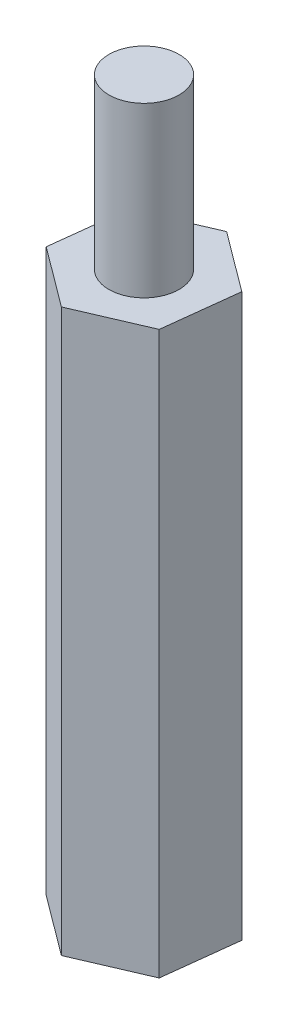
ISO-10303-21;
HEADER;
FILE_DESCRIPTION(('STEP AP214'),'2;1');
FILE_NAME('part.step','',(''),(''),'','','');
FILE_SCHEMA(('AUTOMOTIVE_DESIGN { 1 0 10303 214 1 1 1 1 }'));
ENDSEC;
DATA;
#1=APPLICATION_CONTEXT('core data for automotive mechanical design processes');
#2=APPLICATION_PROTOCOL_DEFINITION('international standard','automotive_design',2000,#1);
#3=PRODUCT_CONTEXT('',#1,'mechanical');
#4=PRODUCT('Part','Part','',(#3));
#5=PRODUCT_RELATED_PRODUCT_CATEGORY('part','',(#4));
#6=PRODUCT_DEFINITION_FORMATION('','',#4);
#7=PRODUCT_DEFINITION_CONTEXT('part definition',#1,'design');
#8=PRODUCT_DEFINITION('design','',#6,#7);
#9=PRODUCT_DEFINITION_SHAPE('','',#8);
#10=(LENGTH_UNIT() NAMED_UNIT(*) SI_UNIT(.MILLI.,.METRE.));
#11=(NAMED_UNIT(*) PLANE_ANGLE_UNIT() SI_UNIT($,.RADIAN.));
#12=(NAMED_UNIT(*) SI_UNIT($,.STERADIAN.) SOLID_ANGLE_UNIT());
#13=UNCERTAINTY_MEASURE_WITH_UNIT(LENGTH_MEASURE(1.E-05),#10,'distance_accuracy_value','');
#14=(GEOMETRIC_REPRESENTATION_CONTEXT(3) GLOBAL_UNCERTAINTY_ASSIGNED_CONTEXT((#13)) GLOBAL_UNIT_ASSIGNED_CONTEXT((#10,
#11,#12)) REPRESENTATION_CONTEXT('',''));
#15=CARTESIAN_POINT('',(0.,0.,0.));
#16=DIRECTION('',(0.,0.,1.));
#17=DIRECTION('',(1.,0.,0.));
#18=AXIS2_PLACEMENT_3D('',#15,#16,#17);
#19=CARTESIAN_POINT('',(-0.30848263547383,20.,2.63198375063584));
#20=DIRECTION('',(-0.395787953347626,0.,-0.918341927598265));
#21=DIRECTION('',(-0.918341927598265,0.,0.395787953347627));
#22=AXIS2_PLACEMENT_3D('',#19,#20,#21);
#23=PLANE('',#22);
#24=DIRECTION('',(0.918341927598265,0.,-0.395787953347626));
#25=VECTOR('',#24,1.);
#26=CARTESIAN_POINT('',(-0.30848263547383,0.,2.63198375063584));
#27=LINE('',#26,#25);
#28=CARTESIAN_POINT('',(-0.30848263547383,0.,2.63198375063584));
#29=VERTEX_POINT('',#28);
#30=CARTESIAN_POINT('',(2.12512347266157,0.,1.58314567426463));
#31=VERTEX_POINT('',#30);
#32=EDGE_CURVE('E125',#29,#31,#27,.T.);
#33=ORIENTED_EDGE('',*,*,#32,.T.);
#34=DIRECTION('',(0.,-1.,0.));
#35=VECTOR('',#34,1.);
#36=CARTESIAN_POINT('',(2.12512347266157,20.,1.58314567426463));
#37=LINE('',#36,#35);
#38=CARTESIAN_POINT('',(2.12512347266157,20.,1.58314567426463));
#39=VERTEX_POINT('',#38);
#40=EDGE_CURVE('E42',#39,#31,#37,.T.);
#41=ORIENTED_EDGE('',*,*,#40,.F.);
#42=DIRECTION('',(0.918341927598265,0.,-0.395787953347626));
#43=VECTOR('',#42,1.);
#44=CARTESIAN_POINT('',(-0.30848263547383,20.,2.63198375063584));
#45=LINE('',#44,#43);
#46=CARTESIAN_POINT('',(-0.30848263547383,20.,2.63198375063584));
#47=VERTEX_POINT('',#46);
#48=EDGE_CURVE('E136',#47,#39,#45,.T.);
#49=ORIENTED_EDGE('',*,*,#48,.F.);
#50=DIRECTION('',(0.,-1.,0.));
#51=VECTOR('',#50,1.);
#52=CARTESIAN_POINT('',(-0.30848263547383,20.,2.63198375063584));
#53=LINE('',#52,#51);
#54=EDGE_CURVE('E121',#47,#29,#53,.T.);
#55=ORIENTED_EDGE('',*,*,#54,.T.);
#56=EDGE_LOOP('',(#33,#41,#49,#55));
#57=FACE_BOUND('',#56,.T.);
#58=ADVANCED_FACE('F39',(#57),#23,.F.);
#59=CARTESIAN_POINT('',(2.12512347266157,20.,1.58314567426463));
#60=DIRECTION('',(-0.993201415334281,0.,-0.116408541688238));
#61=DIRECTION('',(-0.116408541688238,0.,0.993201415334281));
#62=AXIS2_PLACEMENT_3D('',#59,#60,#61);
#63=PLANE('',#62);
#64=DIRECTION('',(0.116408541688238,0.,-0.99320141533428));
#65=VECTOR('',#64,1.);
#66=CARTESIAN_POINT('',(2.12512347266157,0.,1.58314567426463));
#67=LINE('',#66,#65);
#68=CARTESIAN_POINT('',(2.4336061081354,0.,-1.04883807637121));
#69=VERTEX_POINT('',#68);
#70=EDGE_CURVE('E128',#31,#69,#67,.T.);
#71=ORIENTED_EDGE('',*,*,#70,.T.);
#72=DIRECTION('',(0.,-1.,0.));
#73=VECTOR('',#72,1.);
#74=CARTESIAN_POINT('',(2.4336061081354,20.,-1.04883807637121));
#75=LINE('',#74,#73);
#76=CARTESIAN_POINT('',(2.4336061081354,20.,-1.04883807637121));
#77=VERTEX_POINT('',#76);
#78=EDGE_CURVE('E139',#77,#69,#75,.T.);
#79=ORIENTED_EDGE('',*,*,#78,.F.);
#80=DIRECTION('',(0.116408541688238,0.,-0.99320141533428));
#81=VECTOR('',#80,1.);
#82=CARTESIAN_POINT('',(2.12512347266157,20.,1.58314567426463));
#83=LINE('',#82,#81);
#84=EDGE_CURVE('E94',#39,#77,#83,.T.);
#85=ORIENTED_EDGE('',*,*,#84,.F.);
#86=ORIENTED_EDGE('',*,*,#40,.T.);
#87=EDGE_LOOP('',(#71,#79,#85,#86));
#88=FACE_BOUND('',#87,.T.);
#89=ADVANCED_FACE('F144',(#88),#63,.F.);
#90=CARTESIAN_POINT('',(2.4336061081354,20.,-1.04883807637121));
#91=DIRECTION('',(-0.597413461986654,0.,0.801933385910027));
#92=DIRECTION('',(0.801933385910027,0.,0.597413461986654));
#93=AXIS2_PLACEMENT_3D('',#90,#91,#92);
#94=PLANE('',#93);
#95=DIRECTION('',(-0.801933385910027,0.,-0.597413461986654));
#96=VECTOR('',#95,1.);
#97=CARTESIAN_POINT('',(2.4336061081354,0.,-1.04883807637121));
#98=LINE('',#97,#96);
#99=CARTESIAN_POINT('',(0.308482635473831,0.,-2.63198375063584));
#100=VERTEX_POINT('',#99);
#101=EDGE_CURVE('E131',#69,#100,#98,.T.);
#102=ORIENTED_EDGE('',*,*,#101,.T.);
#103=DIRECTION('',(0.,-1.,0.));
#104=VECTOR('',#103,1.);
#105=CARTESIAN_POINT('',(0.308482635473831,20.,-2.63198375063584));
#106=LINE('',#105,#104);
#107=CARTESIAN_POINT('',(0.308482635473831,20.,-2.63198375063584));
#108=VERTEX_POINT('',#107);
#109=EDGE_CURVE('E116',#108,#100,#106,.T.);
#110=ORIENTED_EDGE('',*,*,#109,.F.);
#111=DIRECTION('',(-0.801933385910027,0.,-0.597413461986654));
#112=VECTOR('',#111,1.);
#113=CARTESIAN_POINT('',(2.4336061081354,20.,-1.04883807637121));
#114=LINE('',#113,#112);
#115=EDGE_CURVE('E107',#77,#108,#114,.T.);
#116=ORIENTED_EDGE('',*,*,#115,.F.);
#117=ORIENTED_EDGE('',*,*,#78,.T.);
#118=EDGE_LOOP('',(#102,#110,#116,#117));
#119=FACE_BOUND('',#118,.T.);
#120=ADVANCED_FACE('F150',(#119),#94,.F.);
#121=CARTESIAN_POINT('',(0.308482635473831,20.,-2.63198375063584));
#122=DIRECTION('',(0.395787953347626,0.,0.918341927598265));
#123=DIRECTION('',(0.918341927598265,0.,-0.395787953347626));
#124=AXIS2_PLACEMENT_3D('',#121,#122,#123);
#125=PLANE('',#124);
#126=DIRECTION('',(-0.918341927598265,0.,0.395787953347626));
#127=VECTOR('',#126,1.);
#128=CARTESIAN_POINT('',(0.308482635473831,0.,-2.63198375063584));
#129=LINE('',#128,#127);
#130=CARTESIAN_POINT('',(-2.12512347266157,0.,-1.58314567426463));
#131=VERTEX_POINT('',#130);
#132=EDGE_CURVE('E115',#100,#131,#129,.T.);
#133=ORIENTED_EDGE('',*,*,#132,.T.);
#134=DIRECTION('',(0.,-1.,0.));
#135=VECTOR('',#134,1.);
#136=CARTESIAN_POINT('',(-2.12512347266157,20.,-1.58314567426463));
#137=LINE('',#136,#135);
#138=CARTESIAN_POINT('',(-2.12512347266157,20.,-1.58314567426463));
#139=VERTEX_POINT('',#138);
#140=EDGE_CURVE('E112',#139,#131,#137,.T.);
#141=ORIENTED_EDGE('',*,*,#140,.F.);
#142=DIRECTION('',(-0.918341927598265,0.,0.395787953347626));
#143=VECTOR('',#142,1.);
#144=CARTESIAN_POINT('',(0.308482635473831,20.,-2.63198375063584));
#145=LINE('',#144,#143);
#146=EDGE_CURVE('E101',#108,#139,#145,.T.);
#147=ORIENTED_EDGE('',*,*,#146,.F.);
#148=ORIENTED_EDGE('',*,*,#109,.T.);
#149=EDGE_LOOP('',(#133,#141,#147,#148));
#150=FACE_BOUND('',#149,.T.);
#151=ADVANCED_FACE('F113',(#150),#125,.F.);
#152=CARTESIAN_POINT('',(-2.12512347266157,20.,-1.58314567426463));
#153=DIRECTION('',(0.993201415334281,0.,0.116408541688238));
#154=DIRECTION('',(0.116408541688238,0.,-0.993201415334281));
#155=AXIS2_PLACEMENT_3D('',#152,#153,#154);
#156=PLANE('',#155);
#157=DIRECTION('',(-0.116408541688238,0.,0.99320141533428));
#158=VECTOR('',#157,1.);
#159=CARTESIAN_POINT('',(-2.12512347266157,0.,-1.58314567426463));
#160=LINE('',#159,#158);
#161=CARTESIAN_POINT('',(-2.4336061081354,0.,1.04883807637121));
#162=VERTEX_POINT('',#161);
#163=EDGE_CURVE('E79',#131,#162,#160,.T.);
#164=ORIENTED_EDGE('',*,*,#163,.T.);
#165=DIRECTION('',(0.,-1.,0.));
#166=VECTOR('',#165,1.);
#167=CARTESIAN_POINT('',(-2.4336061081354,20.,1.04883807637121));
#168=LINE('',#167,#166);
#169=CARTESIAN_POINT('',(-2.4336061081354,20.,1.04883807637121));
#170=VERTEX_POINT('',#169);
#171=EDGE_CURVE('E117',#170,#162,#168,.T.);
#172=ORIENTED_EDGE('',*,*,#171,.F.);
#173=DIRECTION('',(-0.116408541688238,0.,0.99320141533428));
#174=VECTOR('',#173,1.);
#175=CARTESIAN_POINT('',(-2.12512347266157,20.,-1.58314567426463));
#176=LINE('',#175,#174);
#177=EDGE_CURVE('E105',#139,#170,#176,.T.);
#178=ORIENTED_EDGE('',*,*,#177,.F.);
#179=ORIENTED_EDGE('',*,*,#140,.T.);
#180=EDGE_LOOP('',(#164,#172,#178,#179));
#181=FACE_BOUND('',#180,.T.);
#182=ADVANCED_FACE('F119',(#181),#156,.F.);
#183=CARTESIAN_POINT('',(-2.4336061081354,20.,1.04883807637121));
#184=DIRECTION('',(0.597413461986654,0.,-0.801933385910027));
#185=DIRECTION('',(-0.801933385910027,0.,-0.597413461986654));
#186=AXIS2_PLACEMENT_3D('',#183,#184,#185);
#187=PLANE('',#186);
#188=DIRECTION('',(0.801933385910027,0.,0.597413461986654));
#189=VECTOR('',#188,1.);
#190=CARTESIAN_POINT('',(-2.4336061081354,0.,1.04883807637121));
#191=LINE('',#190,#189);
#192=EDGE_CURVE('E85',#162,#29,#191,.T.);
#193=ORIENTED_EDGE('',*,*,#192,.T.);
#194=ORIENTED_EDGE('',*,*,#54,.F.);
#195=DIRECTION('',(0.801933385910027,0.,0.597413461986654));
#196=VECTOR('',#195,1.);
#197=CARTESIAN_POINT('',(-2.4336061081354,20.,1.04883807637121));
#198=LINE('',#197,#196);
#199=EDGE_CURVE('E56',#170,#47,#198,.T.);
#200=ORIENTED_EDGE('',*,*,#199,.F.);
#201=ORIENTED_EDGE('',*,*,#171,.T.);
#202=EDGE_LOOP('',(#193,#194,#200,#201));
#203=FACE_BOUND('',#202,.T.);
#204=ADVANCED_FACE('F181',(#203),#187,.F.);
#205=CARTESIAN_POINT('',(0.,20.,0.));
#206=DIRECTION('',(0.,1.,0.));
#207=DIRECTION('',(0.,0.,1.));
#208=AXIS2_PLACEMENT_3D('',#205,#206,#207);
#209=PLANE('',#208);
#210=CARTESIAN_POINT('',(0.,20.,0.));
#211=DIRECTION('',(0.,1.,0.));
#212=DIRECTION('',(0.,0.,1.));
#213=AXIS2_PLACEMENT_3D('',#210,#211,#212);
#214=CIRCLE('',#213,1.25);
#215=CARTESIAN_POINT('',(0.,20.,1.25));
#216=VERTEX_POINT('',#215);
#217=EDGE_CURVE('E11',#216,#216,#214,.T.);
#218=ORIENTED_EDGE('',*,*,#217,.F.);
#219=EDGE_LOOP('',(#218));
#220=FACE_BOUND('',#219,.T.);
#221=ORIENTED_EDGE('',*,*,#48,.T.);
#222=ORIENTED_EDGE('',*,*,#84,.T.);
#223=ORIENTED_EDGE('',*,*,#115,.T.);
#224=ORIENTED_EDGE('',*,*,#146,.T.);
#225=ORIENTED_EDGE('',*,*,#177,.T.);
#226=ORIENTED_EDGE('',*,*,#199,.T.);
#227=EDGE_LOOP('',(#221,#222,#223,#224,#225,#226));
#228=FACE_BOUND('',#227,.T.);
#229=ADVANCED_FACE('F103',(#220,#228),#209,.T.);
#230=CARTESIAN_POINT('',(0.,0.,0.));
#231=DIRECTION('',(0.,1.,0.));
#232=DIRECTION('',(0.,0.,1.));
#233=AXIS2_PLACEMENT_3D('',#230,#231,#232);
#234=PLANE('',#233);
#235=CARTESIAN_POINT('',(0.,0.,0.));
#236=DIRECTION('',(0.,-1.,0.));
#237=DIRECTION('',(0.,0.,-1.));
#238=AXIS2_PLACEMENT_3D('',#235,#236,#237);
#239=CIRCLE('',#238,1.25);
#240=CARTESIAN_POINT('',(0.,0.,-1.25));
#241=VERTEX_POINT('',#240);
#242=EDGE_CURVE('E157',#241,#241,#239,.T.);
#243=ORIENTED_EDGE('',*,*,#242,.F.);
#244=EDGE_LOOP('',(#243));
#245=FACE_BOUND('',#244,.T.);
#246=ORIENTED_EDGE('',*,*,#32,.F.);
#247=ORIENTED_EDGE('',*,*,#192,.F.);
#248=ORIENTED_EDGE('',*,*,#163,.F.);
#249=ORIENTED_EDGE('',*,*,#132,.F.);
#250=ORIENTED_EDGE('',*,*,#101,.F.);
#251=ORIENTED_EDGE('',*,*,#70,.F.);
#252=EDGE_LOOP('',(#246,#247,#248,#249,#250,#251));
#253=FACE_BOUND('',#252,.T.);
#254=ADVANCED_FACE('F149',(#245,#253),#234,.F.);
#255=CARTESIAN_POINT('',(0.,26.,0.));
#256=DIRECTION('',(0.,-1.,0.));
#257=DIRECTION('',(0.,0.,-1.));
#258=AXIS2_PLACEMENT_3D('',#255,#256,#257);
#259=CYLINDRICAL_SURFACE('',#258,1.25);
#260=CARTESIAN_POINT('',(0.,26.,0.));
#261=DIRECTION('',(0.,1.,0.));
#262=DIRECTION('',(0.,0.,1.));
#263=AXIS2_PLACEMENT_3D('',#260,#261,#262);
#264=CIRCLE('',#263,1.25);
#265=CARTESIAN_POINT('',(0.,26.,1.25));
#266=VERTEX_POINT('',#265);
#267=EDGE_CURVE('E129',#266,#266,#264,.T.);
#268=ORIENTED_EDGE('',*,*,#267,.F.);
#269=EDGE_LOOP('',(#268));
#270=FACE_BOUND('',#269,.T.);
#271=ORIENTED_EDGE('',*,*,#217,.T.);
#272=EDGE_LOOP('',(#271));
#273=FACE_BOUND('',#272,.T.);
#274=ADVANCED_FACE('F173',(#270,#273),#259,.T.);
#275=CARTESIAN_POINT('',(0.,26.,0.));
#276=DIRECTION('',(0.,1.,0.));
#277=DIRECTION('',(0.,0.,1.));
#278=AXIS2_PLACEMENT_3D('',#275,#276,#277);
#279=PLANE('',#278);
#280=ORIENTED_EDGE('',*,*,#267,.T.);
#281=EDGE_LOOP('',(#280));
#282=FACE_BOUND('',#281,.T.);
#283=ADVANCED_FACE('F168',(#282),#279,.T.);
#284=CARTESIAN_POINT('',(0.,6.,0.));
#285=DIRECTION('',(0.,-1.,0.));
#286=DIRECTION('',(0.,0.,-1.));
#287=AXIS2_PLACEMENT_3D('',#284,#285,#286);
#288=CYLINDRICAL_SURFACE('',#287,1.25);
#289=CARTESIAN_POINT('',(0.,6.,0.));
#290=DIRECTION('',(0.,-1.,0.));
#291=DIRECTION('',(0.,0.,-1.));
#292=AXIS2_PLACEMENT_3D('',#289,#290,#291);
#293=CIRCLE('',#292,1.25);
#294=CARTESIAN_POINT('',(0.,6.,-1.25));
#295=VERTEX_POINT('',#294);
#296=EDGE_CURVE('E156',#295,#295,#293,.T.);
#297=ORIENTED_EDGE('',*,*,#296,.F.);
#298=EDGE_LOOP('',(#297));
#299=FACE_BOUND('',#298,.T.);
#300=ORIENTED_EDGE('',*,*,#242,.T.);
#301=EDGE_LOOP('',(#300));
#302=FACE_BOUND('',#301,.T.);
#303=ADVANCED_FACE('F165',(#299,#302),#288,.F.);
#304=CARTESIAN_POINT('',(0.,6.,0.));
#305=DIRECTION('',(0.,-1.,0.));
#306=DIRECTION('',(0.,0.,-1.));
#307=AXIS2_PLACEMENT_3D('',#304,#305,#306);
#308=PLANE('',#307);
#309=ORIENTED_EDGE('',*,*,#296,.T.);
#310=EDGE_LOOP('',(#309));
#311=FACE_BOUND('',#310,.T.);
#312=ADVANCED_FACE('F163',(#311),#308,.T.);
#313=CLOSED_SHELL('',(#58,#89,#120,#151,#182,#204,#229,#254,#274,#283,#303,#312));
#314=MANIFOLD_SOLID_BREP('B2',#313);
#315=ADVANCED_BREP_SHAPE_REPRESENTATION('',(#18,#314),#14);
#316=SHAPE_DEFINITION_REPRESENTATION(#9,#315);
ENDSEC;
END-ISO-10303-21;
